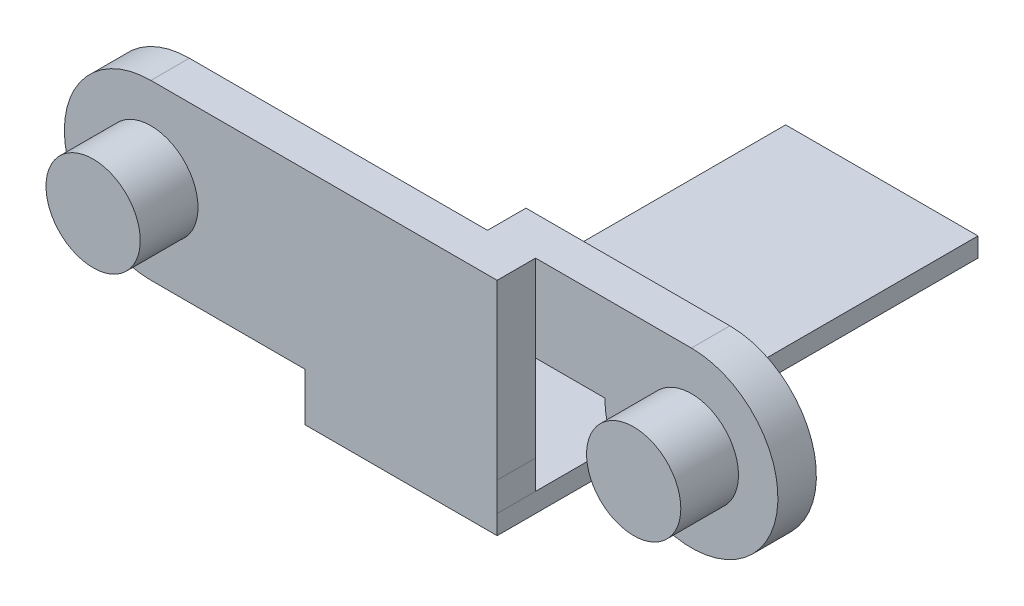
ISO-10303-21;
HEADER;
FILE_DESCRIPTION(('STEP AP214'),'2;1');
FILE_NAME('part.step','',(''),(''),'','','');
FILE_SCHEMA(('AUTOMOTIVE_DESIGN { 1 0 10303 214 1 1 1 1 }'));
ENDSEC;
DATA;
#1=APPLICATION_CONTEXT('core data for automotive mechanical design processes');
#2=APPLICATION_PROTOCOL_DEFINITION('international standard','automotive_design',2000,#1);
#3=PRODUCT_CONTEXT('',#1,'mechanical');
#4=PRODUCT('Part','Part','',(#3));
#5=PRODUCT_RELATED_PRODUCT_CATEGORY('part','',(#4));
#6=PRODUCT_DEFINITION_FORMATION('','',#4);
#7=PRODUCT_DEFINITION_CONTEXT('part definition',#1,'design');
#8=PRODUCT_DEFINITION('design','',#6,#7);
#9=PRODUCT_DEFINITION_SHAPE('','',#8);
#10=(LENGTH_UNIT() NAMED_UNIT(*) SI_UNIT(.MILLI.,.METRE.));
#11=(NAMED_UNIT(*) PLANE_ANGLE_UNIT() SI_UNIT($,.RADIAN.));
#12=(NAMED_UNIT(*) SI_UNIT($,.STERADIAN.) SOLID_ANGLE_UNIT());
#13=UNCERTAINTY_MEASURE_WITH_UNIT(LENGTH_MEASURE(1.E-05),#10,'distance_accuracy_value','');
#14=(GEOMETRIC_REPRESENTATION_CONTEXT(3) GLOBAL_UNCERTAINTY_ASSIGNED_CONTEXT((#13)) GLOBAL_UNIT_ASSIGNED_CONTEXT((#10,
#11,#12)) REPRESENTATION_CONTEXT('',''));
#15=CARTESIAN_POINT('',(0.,0.,0.));
#16=DIRECTION('',(0.,0.,1.));
#17=DIRECTION('',(1.,0.,0.));
#18=AXIS2_PLACEMENT_3D('',#15,#16,#17);
#19=CARTESIAN_POINT('',(0.,0.,0.));
#20=DIRECTION('',(0.,0.,1.));
#21=DIRECTION('',(1.,0.,0.));
#22=AXIS2_PLACEMENT_3D('',#19,#20,#21);
#23=PLANE('',#22);
#24=CARTESIAN_POINT('',(-78.460741065967,-7.81033927026465,0.));
#25=DIRECTION('',(0.,0.,1.));
#26=DIRECTION('',(1.,0.,0.));
#27=AXIS2_PLACEMENT_3D('',#24,#25,#26);
#28=CIRCLE('',#27,2.45);
#29=CARTESIAN_POINT('',(-80.6400024523847,-8.9298569385793,0.));
#30=VERTEX_POINT('',#29);
#31=CARTESIAN_POINT('',(-76.2859725964851,-6.68211850102341,0.));
#32=VERTEX_POINT('',#31);
#33=EDGE_CURVE('E55',#30,#32,#28,.T.);
#34=ORIENTED_EDGE('',*,*,#33,.T.);
#35=CARTESIAN_POINT('',(-78.4652339829028,-7.80163616933807,0.));
#36=DIRECTION('',(0.,0.,-1.));
#37=DIRECTION('',(-1.,0.,0.));
#38=AXIS2_PLACEMENT_3D('',#35,#36,#37);
#39=CIRCLE('',#38,2.45);
#40=EDGE_CURVE('E167',#32,#30,#39,.T.);
#41=ORIENTED_EDGE('',*,*,#40,.T.);
#42=EDGE_LOOP('',(#34,#41));
#43=FACE_BOUND('',#42,.T.);
#44=DIRECTION('',(1.,0.,0.));
#45=VECTOR('',#44,1.);
#46=CARTESIAN_POINT('',(0.,-13.8103392702646,0.));
#47=LINE('',#46,#45);
#48=CARTESIAN_POINT('',(-70.4585846447346,-13.8103392702646,0.));
#49=VERTEX_POINT('',#48);
#50=CARTESIAN_POINT('',(-60.4585846447346,-13.8103392702646,0.));
#51=VERTEX_POINT('',#50);
#52=EDGE_CURVE('E169',#49,#51,#47,.T.);
#53=ORIENTED_EDGE('',*,*,#52,.F.);
#54=DIRECTION('',(0.,1.,0.));
#55=VECTOR('',#54,1.);
#56=CARTESIAN_POINT('',(-70.4585846447346,0.,0.));
#57=LINE('',#56,#55);
#58=CARTESIAN_POINT('',(-70.4585846447346,-12.3103392702647,0.));
#59=VERTEX_POINT('',#58);
#60=EDGE_CURVE('E303',#49,#59,#57,.T.);
#61=ORIENTED_EDGE('',*,*,#60,.T.);
#62=DIRECTION('',(-1.,0.,0.));
#63=VECTOR('',#62,1.);
#64=CARTESIAN_POINT('',(0.,-12.3103392702647,0.));
#65=LINE('',#64,#63);
#66=CARTESIAN_POINT('',(-78.460741065967,-12.3103392702647,0.));
#67=VERTEX_POINT('',#66);
#68=EDGE_CURVE('E299',#59,#67,#65,.T.);
#69=ORIENTED_EDGE('',*,*,#68,.T.);
#70=CARTESIAN_POINT('',(-78.460741065967,-7.81033927026465,0.));
#71=DIRECTION('',(0.,0.,1.));
#72=DIRECTION('',(1.,0.,0.));
#73=AXIS2_PLACEMENT_3D('',#70,#71,#72);
#74=CIRCLE('',#73,4.5);
#75=CARTESIAN_POINT('',(-78.460741065967,-3.31033927026466,0.));
#76=VERTEX_POINT('',#75);
#77=EDGE_CURVE('E295',#76,#67,#74,.T.);
#78=ORIENTED_EDGE('',*,*,#77,.F.);
#79=DIRECTION('',(-1.,0.,0.));
#80=VECTOR('',#79,1.);
#81=CARTESIAN_POINT('',(0.,-3.31033927026466,0.));
#82=LINE('',#81,#80);
#83=CARTESIAN_POINT('',(-62.960741065967,-3.31033927026466,0.));
#84=VERTEX_POINT('',#83);
#85=EDGE_CURVE('E292',#84,#76,#82,.T.);
#86=ORIENTED_EDGE('',*,*,#85,.F.);
#87=DIRECTION('',(0.,1.,0.));
#88=VECTOR('',#87,1.);
#89=CARTESIAN_POINT('',(-62.960741065967,-3.31033927026466,0.));
#90=LINE('',#89,#88);
#91=CARTESIAN_POINT('',(-62.960741065967,-7.81033927026466,0.));
#92=VERTEX_POINT('',#91);
#93=EDGE_CURVE('E248',#92,#84,#90,.T.);
#94=ORIENTED_EDGE('',*,*,#93,.F.);
#95=DIRECTION('',(-1.,0.,0.));
#96=VECTOR('',#95,1.);
#97=CARTESIAN_POINT('',(-60.460741065967,-7.81033927026466,0.));
#98=LINE('',#97,#96);
#99=CARTESIAN_POINT('',(-60.460741065967,-7.81033927026466,0.));
#100=VERTEX_POINT('',#99);
#101=EDGE_CURVE('E241',#100,#92,#98,.T.);
#102=ORIENTED_EDGE('',*,*,#101,.F.);
#103=DIRECTION('',(0.,-1.,0.));
#104=VECTOR('',#103,1.);
#105=CARTESIAN_POINT('',(-60.460741065967,0.,0.));
#106=LINE('',#105,#104);
#107=CARTESIAN_POINT('',(-60.460741065967,-12.3103392702646,0.));
#108=VERTEX_POINT('',#107);
#109=EDGE_CURVE('E156',#100,#108,#106,.T.);
#110=ORIENTED_EDGE('',*,*,#109,.T.);
#111=DIRECTION('',(-0.00143761266932871,0.999998966634373,0.));
#112=VECTOR('',#111,1.);
#113=CARTESIAN_POINT('',(-60.478313591339,-0.0869444796839806,0.));
#114=LINE('',#113,#112);
#115=EDGE_CURVE('E306',#51,#108,#114,.T.);
#116=ORIENTED_EDGE('',*,*,#115,.F.);
#117=EDGE_LOOP('',(#53,#61,#69,#78,#86,#94,#102,#110,#116));
#118=FACE_BOUND('',#117,.T.);
#119=ADVANCED_FACE('F39',(#43,#118),#23,.F.);
#120=CARTESIAN_POINT('',(0.,-3.31033927026466,2.));
#121=DIRECTION('',(0.,-1.,0.));
#122=DIRECTION('',(1.,0.,0.));
#123=AXIS2_PLACEMENT_3D('',#120,#121,#122);
#124=PLANE('',#123);
#125=DIRECTION('',(0.,0.,-1.));
#126=VECTOR('',#125,1.);
#127=CARTESIAN_POINT('',(-60.460741065967,-3.31033927026466,2.));
#128=LINE('',#127,#126);
#129=CARTESIAN_POINT('',(-60.460741065967,-3.31033927026466,2.));
#130=VERTEX_POINT('',#129);
#131=CARTESIAN_POINT('',(-60.460741065967,-3.31033927026466,0.));
#132=VERTEX_POINT('',#131);
#133=EDGE_CURVE('E289',#130,#132,#128,.T.);
#134=ORIENTED_EDGE('',*,*,#133,.T.);
#135=DIRECTION('',(-1.,0.,0.));
#136=VECTOR('',#135,1.);
#137=CARTESIAN_POINT('',(0.,-3.31033927026466,0.));
#138=LINE('',#137,#136);
#139=CARTESIAN_POINT('',(-52.360741065967,-3.31033927026466,0.));
#140=VERTEX_POINT('',#139);
#141=EDGE_CURVE('E232',#140,#132,#138,.T.);
#142=ORIENTED_EDGE('',*,*,#141,.F.);
#143=DIRECTION('',(0.,0.,1.));
#144=VECTOR('',#143,1.);
#145=CARTESIAN_POINT('',(-52.360741065967,-3.31033927026466,-2.));
#146=LINE('',#145,#144);
#147=CARTESIAN_POINT('',(-52.360741065967,-3.31033927026466,-2.));
#148=VERTEX_POINT('',#147);
#149=EDGE_CURVE('E238',#148,#140,#146,.T.);
#150=ORIENTED_EDGE('',*,*,#149,.F.);
#151=DIRECTION('',(1.,0.,0.));
#152=VECTOR('',#151,1.);
#153=CARTESIAN_POINT('',(-60.460741065967,-3.31033927026466,-2.));
#154=LINE('',#153,#152);
#155=CARTESIAN_POINT('',(-62.960741065967,-3.31033927026466,-2.));
#156=VERTEX_POINT('',#155);
#157=EDGE_CURVE('E251',#156,#148,#154,.T.);
#158=ORIENTED_EDGE('',*,*,#157,.F.);
#159=DIRECTION('',(0.,0.,1.));
#160=VECTOR('',#159,1.);
#161=CARTESIAN_POINT('',(-62.960741065967,-3.31033927026466,-2.));
#162=LINE('',#161,#160);
#163=EDGE_CURVE('E254',#156,#84,#162,.T.);
#164=ORIENTED_EDGE('',*,*,#163,.T.);
#165=ORIENTED_EDGE('',*,*,#85,.T.);
#166=DIRECTION('',(0.,0.,-1.));
#167=VECTOR('',#166,1.);
#168=CARTESIAN_POINT('',(-78.460741065967,-3.31033927026466,2.));
#169=LINE('',#168,#167);
#170=CARTESIAN_POINT('',(-78.460741065967,-3.31033927026466,2.));
#171=VERTEX_POINT('',#170);
#172=EDGE_CURVE('E48',#171,#76,#169,.T.);
#173=ORIENTED_EDGE('',*,*,#172,.F.);
#174=DIRECTION('',(-1.,0.,0.));
#175=VECTOR('',#174,1.);
#176=CARTESIAN_POINT('',(0.,-3.31033927026466,2.));
#177=LINE('',#176,#175);
#178=EDGE_CURVE('E155',#130,#171,#177,.T.);
#179=ORIENTED_EDGE('',*,*,#178,.F.);
#180=EDGE_LOOP('',(#134,#142,#150,#158,#164,#165,#173,#179));
#181=FACE_BOUND('',#180,.T.);
#182=ADVANCED_FACE('F338',(#181),#124,.F.);
#183=CARTESIAN_POINT('',(-78.460741065967,-7.81033927026465,2.));
#184=DIRECTION('',(0.,0.,-1.));
#185=DIRECTION('',(-1.,0.,0.));
#186=AXIS2_PLACEMENT_3D('',#183,#184,#185);
#187=CYLINDRICAL_SURFACE('',#186,4.5);
#188=ORIENTED_EDGE('',*,*,#77,.T.);
#189=DIRECTION('',(0.,0.,-1.));
#190=VECTOR('',#189,1.);
#191=CARTESIAN_POINT('',(-78.460741065967,-12.3103392702647,2.));
#192=LINE('',#191,#190);
#193=CARTESIAN_POINT('',(-78.460741065967,-12.3103392702647,2.));
#194=VERTEX_POINT('',#193);
#195=EDGE_CURVE('E327',#194,#67,#192,.T.);
#196=ORIENTED_EDGE('',*,*,#195,.F.);
#197=CARTESIAN_POINT('',(-78.460741065967,-7.81033927026465,2.));
#198=DIRECTION('',(0.,0.,1.));
#199=DIRECTION('',(1.,0.,0.));
#200=AXIS2_PLACEMENT_3D('',#197,#198,#199);
#201=CIRCLE('',#200,4.5);
#202=EDGE_CURVE('E271',#171,#194,#201,.T.);
#203=ORIENTED_EDGE('',*,*,#202,.F.);
#204=ORIENTED_EDGE('',*,*,#172,.T.);
#205=EDGE_LOOP('',(#188,#196,#203,#204));
#206=FACE_BOUND('',#205,.T.);
#207=ADVANCED_FACE('F333',(#206),#187,.T.);
#208=CARTESIAN_POINT('',(0.,-12.3103392702647,2.));
#209=DIRECTION('',(0.,-1.,0.));
#210=DIRECTION('',(0.,0.,-1.));
#211=AXIS2_PLACEMENT_3D('',#208,#209,#210);
#212=PLANE('',#211);
#213=ORIENTED_EDGE('',*,*,#68,.F.);
#214=DIRECTION('',(0.,0.,-1.));
#215=VECTOR('',#214,1.);
#216=CARTESIAN_POINT('',(-70.4585846447346,-12.3103392702647,2.));
#217=LINE('',#216,#215);
#218=CARTESIAN_POINT('',(-70.4585846447346,-12.3103392702647,2.));
#219=VERTEX_POINT('',#218);
#220=EDGE_CURVE('E323',#219,#59,#217,.T.);
#221=ORIENTED_EDGE('',*,*,#220,.F.);
#222=DIRECTION('',(-1.,0.,0.));
#223=VECTOR('',#222,1.);
#224=CARTESIAN_POINT('',(0.,-12.3103392702647,2.));
#225=LINE('',#224,#223);
#226=EDGE_CURVE('E274',#219,#194,#225,.T.);
#227=ORIENTED_EDGE('',*,*,#226,.T.);
#228=ORIENTED_EDGE('',*,*,#195,.T.);
#229=EDGE_LOOP('',(#213,#221,#227,#228));
#230=FACE_BOUND('',#229,.T.);
#231=ADVANCED_FACE('F347',(#230),#212,.T.);
#232=CARTESIAN_POINT('',(-70.4585846447346,0.,2.));
#233=DIRECTION('',(-1.,0.,0.));
#234=DIRECTION('',(0.,0.,1.));
#235=AXIS2_PLACEMENT_3D('',#232,#233,#234);
#236=PLANE('',#235);
#237=ORIENTED_EDGE('',*,*,#60,.F.);
#238=DIRECTION('',(0.,0.,1.));
#239=VECTOR('',#238,1.);
#240=CARTESIAN_POINT('',(-70.4585846447346,-13.8103392702646,-23.));
#241=LINE('',#240,#239);
#242=CARTESIAN_POINT('',(-70.4585846447346,-13.8103392702646,-23.));
#243=VERTEX_POINT('',#242);
#244=EDGE_CURVE('E192',#243,#49,#241,.T.);
#245=ORIENTED_EDGE('',*,*,#244,.F.);
#246=DIRECTION('',(0.,-1.,0.));
#247=VECTOR('',#246,1.);
#248=CARTESIAN_POINT('',(-70.4585846447346,0.,-23.));
#249=LINE('',#248,#247);
#250=CARTESIAN_POINT('',(-70.4585846447346,-14.8103392702646,-23.));
#251=VERTEX_POINT('',#250);
#252=EDGE_CURVE('E183',#243,#251,#249,.T.);
#253=ORIENTED_EDGE('',*,*,#252,.T.);
#254=DIRECTION('',(0.,0.,-1.));
#255=VECTOR('',#254,1.);
#256=CARTESIAN_POINT('',(-70.4585846447346,-14.8103392702646,2.));
#257=LINE('',#256,#255);
#258=CARTESIAN_POINT('',(-70.4585846447346,-14.8103392702646,2.));
#259=VERTEX_POINT('',#258);
#260=EDGE_CURVE('E207',#259,#251,#257,.T.);
#261=ORIENTED_EDGE('',*,*,#260,.F.);
#262=DIRECTION('',(0.,1.,0.));
#263=VECTOR('',#262,1.);
#264=CARTESIAN_POINT('',(-70.4585846447346,0.,2.));
#265=LINE('',#264,#263);
#266=EDGE_CURVE('E278',#259,#219,#265,.T.);
#267=ORIENTED_EDGE('',*,*,#266,.T.);
#268=ORIENTED_EDGE('',*,*,#220,.T.);
#269=EDGE_LOOP('',(#237,#245,#253,#261,#267,#268));
#270=FACE_BOUND('',#269,.T.);
#271=ADVANCED_FACE('F352',(#270),#236,.T.);
#272=CARTESIAN_POINT('',(-60.478313591339,-0.0869444796839806,2.));
#273=DIRECTION('',(-0.999998966634373,-0.00143761266932871,0.));
#274=DIRECTION('',(0.00143761266932871,-0.999998966634373,0.));
#275=AXIS2_PLACEMENT_3D('',#272,#273,#274);
#276=PLANE('',#275);
#277=ORIENTED_EDGE('',*,*,#115,.T.);
#278=DIRECTION('',(0.,0.,-1.));
#279=VECTOR('',#278,1.);
#280=CARTESIAN_POINT('',(-60.460741065967,-12.3103392702646,2.));
#281=LINE('',#280,#279);
#282=CARTESIAN_POINT('',(-60.460741065967,-12.3103392702646,2.));
#283=VERTEX_POINT('',#282);
#284=EDGE_CURVE('E315',#283,#108,#281,.T.);
#285=ORIENTED_EDGE('',*,*,#284,.F.);
#286=DIRECTION('',(-0.00143761266932871,0.999998966634373,0.));
#287=VECTOR('',#286,1.);
#288=CARTESIAN_POINT('',(-60.478313591339,-0.0869444796839806,2.));
#289=LINE('',#288,#287);
#290=CARTESIAN_POINT('',(-60.4585846447346,-13.8103392702646,2.));
#291=VERTEX_POINT('',#290);
#292=EDGE_CURVE('E282',#291,#283,#289,.T.);
#293=ORIENTED_EDGE('',*,*,#292,.F.);
#294=DIRECTION('',(0.,0.,-1.));
#295=VECTOR('',#294,1.);
#296=CARTESIAN_POINT('',(-60.4585846447346,-13.8103392702646,2.));
#297=LINE('',#296,#295);
#298=EDGE_CURVE('E319',#291,#51,#297,.T.);
#299=ORIENTED_EDGE('',*,*,#298,.T.);
#300=EDGE_LOOP('',(#277,#285,#293,#299));
#301=FACE_BOUND('',#300,.T.);
#302=ADVANCED_FACE('F367',(#301),#276,.F.);
#303=CARTESIAN_POINT('',(-78.460741065967,-7.81033927026465,2.));
#304=DIRECTION('',(0.,0.,-1.));
#305=DIRECTION('',(-1.,0.,0.));
#306=AXIS2_PLACEMENT_3D('',#303,#304,#305);
#307=CYLINDRICAL_SURFACE('',#306,2.45);
#308=DIRECTION('',(0.,0.,-1.));
#309=VECTOR('',#308,1.);
#310=CARTESIAN_POINT('',(-76.2859725964851,-6.68211850102341,2.5));
#311=LINE('',#310,#309);
#312=CARTESIAN_POINT('',(-76.2859725964851,-6.68211850102341,2.));
#313=VERTEX_POINT('',#312);
#314=EDGE_CURVE('E60',#32,#313,#311,.F.);
#315=ORIENTED_EDGE('',*,*,#314,.F.);
#316=ORIENTED_EDGE('',*,*,#33,.F.);
#317=DIRECTION('',(0.,0.,-1.));
#318=VECTOR('',#317,1.);
#319=CARTESIAN_POINT('',(-80.6400024523847,-8.9298569385793,2.5));
#320=LINE('',#319,#318);
#321=CARTESIAN_POINT('',(-80.6400024523847,-8.92985693857931,2.));
#322=VERTEX_POINT('',#321);
#323=EDGE_CURVE('E158',#322,#30,#320,.T.);
#324=ORIENTED_EDGE('',*,*,#323,.F.);
#325=CARTESIAN_POINT('',(-78.460741065967,-7.81033927026465,2.));
#326=DIRECTION('',(0.,0.,1.));
#327=DIRECTION('',(1.,0.,0.));
#328=AXIS2_PLACEMENT_3D('',#325,#326,#327);
#329=CIRCLE('',#328,2.45);
#330=EDGE_CURVE('E151',#322,#313,#329,.T.);
#331=ORIENTED_EDGE('',*,*,#330,.T.);
#332=EDGE_LOOP('',(#315,#316,#324,#331));
#333=FACE_BOUND('',#332,.T.);
#334=ADVANCED_FACE('F41',(#333),#307,.F.);
#335=CARTESIAN_POINT('',(-60.460741065967,0.,2.));
#336=DIRECTION('',(1.,0.,0.));
#337=DIRECTION('',(0.,0.,-1.));
#338=AXIS2_PLACEMENT_3D('',#335,#336,#337);
#339=PLANE('',#338);
#340=DIRECTION('',(0.,1.,0.));
#341=VECTOR('',#340,1.);
#342=CARTESIAN_POINT('',(-60.460741065967,0.,0.));
#343=LINE('',#342,#341);
#344=EDGE_CURVE('E224',#100,#132,#343,.T.);
#345=ORIENTED_EDGE('',*,*,#344,.T.);
#346=ORIENTED_EDGE('',*,*,#133,.F.);
#347=DIRECTION('',(0.,-1.,0.));
#348=VECTOR('',#347,1.);
#349=CARTESIAN_POINT('',(-60.460741065967,0.,2.));
#350=LINE('',#349,#348);
#351=EDGE_CURVE('E285',#130,#283,#350,.T.);
#352=ORIENTED_EDGE('',*,*,#351,.T.);
#353=ORIENTED_EDGE('',*,*,#284,.T.);
#354=ORIENTED_EDGE('',*,*,#109,.F.);
#355=EDGE_LOOP('',(#345,#346,#352,#353,#354));
#356=FACE_BOUND('',#355,.T.);
#357=ADVANCED_FACE('F371',(#356),#339,.T.);
#358=CARTESIAN_POINT('',(0.,0.,2.));
#359=DIRECTION('',(0.,0.,1.));
#360=DIRECTION('',(1.,0.,0.));
#361=AXIS2_PLACEMENT_3D('',#358,#359,#360);
#362=PLANE('',#361);
#363=CARTESIAN_POINT('',(-78.4652339829028,-7.80163616933807,2.));
#364=DIRECTION('',(0.,0.,1.));
#365=DIRECTION('',(1.,0.,0.));
#366=AXIS2_PLACEMENT_3D('',#363,#364,#365);
#367=CIRCLE('',#366,2.45);
#368=EDGE_CURVE('E11',#313,#322,#367,.T.);
#369=ORIENTED_EDGE('',*,*,#368,.F.);
#370=ORIENTED_EDGE('',*,*,#330,.F.);
#371=EDGE_LOOP('',(#369,#370));
#372=FACE_BOUND('',#371,.T.);
#373=ORIENTED_EDGE('',*,*,#178,.T.);
#374=ORIENTED_EDGE('',*,*,#202,.T.);
#375=ORIENTED_EDGE('',*,*,#226,.F.);
#376=ORIENTED_EDGE('',*,*,#266,.F.);
#377=DIRECTION('',(1.,0.,0.));
#378=VECTOR('',#377,1.);
#379=CARTESIAN_POINT('',(-70.4585846447346,-14.8103392702646,2.));
#380=LINE('',#379,#378);
#381=CARTESIAN_POINT('',(-60.4585846447346,-14.8103392702646,2.));
#382=VERTEX_POINT('',#381);
#383=EDGE_CURVE('E195',#259,#382,#380,.T.);
#384=ORIENTED_EDGE('',*,*,#383,.T.);
#385=DIRECTION('',(0.,1.,0.));
#386=VECTOR('',#385,1.);
#387=CARTESIAN_POINT('',(-60.4585846447346,-13.8103392702646,2.));
#388=LINE('',#387,#386);
#389=EDGE_CURVE('E200',#382,#291,#388,.T.);
#390=ORIENTED_EDGE('',*,*,#389,.T.);
#391=ORIENTED_EDGE('',*,*,#292,.T.);
#392=ORIENTED_EDGE('',*,*,#351,.F.);
#393=EDGE_LOOP('',(#373,#374,#375,#376,#384,#390,#391,#392));
#394=FACE_BOUND('',#393,.T.);
#395=ADVANCED_FACE('F152',(#372,#394),#362,.T.);
#396=CARTESIAN_POINT('',(-60.460741065967,-7.81033927026466,-2.));
#397=DIRECTION('',(0.,1.,0.));
#398=DIRECTION('',(0.,0.,1.));
#399=AXIS2_PLACEMENT_3D('',#396,#397,#398);
#400=PLANE('',#399);
#401=ORIENTED_EDGE('',*,*,#101,.T.);
#402=DIRECTION('',(0.,0.,1.));
#403=VECTOR('',#402,1.);
#404=CARTESIAN_POINT('',(-62.960741065967,-7.81033927026466,-2.));
#405=LINE('',#404,#403);
#406=CARTESIAN_POINT('',(-62.960741065967,-7.81033927026466,-2.));
#407=VERTEX_POINT('',#406);
#408=EDGE_CURVE('E264',#407,#92,#405,.T.);
#409=ORIENTED_EDGE('',*,*,#408,.F.);
#410=DIRECTION('',(-1.,0.,0.));
#411=VECTOR('',#410,1.);
#412=CARTESIAN_POINT('',(-60.460741065967,-7.81033927026466,-2.));
#413=LINE('',#412,#411);
#414=CARTESIAN_POINT('',(-56.860741065967,-7.81033927026466,-2.));
#415=VERTEX_POINT('',#414);
#416=EDGE_CURVE('E244',#415,#407,#413,.T.);
#417=ORIENTED_EDGE('',*,*,#416,.F.);
#418=DIRECTION('',(0.,0.,1.));
#419=VECTOR('',#418,1.);
#420=CARTESIAN_POINT('',(-56.860741065967,-7.81033927026466,-2.));
#421=LINE('',#420,#419);
#422=CARTESIAN_POINT('',(-56.860741065967,-7.81033927026466,0.));
#423=VERTEX_POINT('',#422);
#424=EDGE_CURVE('E223',#415,#423,#421,.T.);
#425=ORIENTED_EDGE('',*,*,#424,.T.);
#426=DIRECTION('',(-1.,0.,0.));
#427=VECTOR('',#426,1.);
#428=CARTESIAN_POINT('',(0.,-7.81033927026466,0.));
#429=LINE('',#428,#427);
#430=EDGE_CURVE('E215',#423,#100,#429,.T.);
#431=ORIENTED_EDGE('',*,*,#430,.T.);
#432=EDGE_LOOP('',(#401,#409,#417,#425,#431));
#433=FACE_BOUND('',#432,.T.);
#434=ADVANCED_FACE('F389',(#433),#400,.F.);
#435=CARTESIAN_POINT('',(-62.960741065967,-3.31033927026466,-2.));
#436=DIRECTION('',(1.,0.,0.));
#437=DIRECTION('',(0.,0.,-1.));
#438=AXIS2_PLACEMENT_3D('',#435,#436,#437);
#439=PLANE('',#438);
#440=ORIENTED_EDGE('',*,*,#93,.T.);
#441=ORIENTED_EDGE('',*,*,#163,.F.);
#442=DIRECTION('',(0.,1.,0.));
#443=VECTOR('',#442,1.);
#444=CARTESIAN_POINT('',(-62.960741065967,-3.31033927026466,-2.));
#445=LINE('',#444,#443);
#446=EDGE_CURVE('E247',#407,#156,#445,.T.);
#447=ORIENTED_EDGE('',*,*,#446,.F.);
#448=ORIENTED_EDGE('',*,*,#408,.T.);
#449=EDGE_LOOP('',(#440,#441,#447,#448));
#450=FACE_BOUND('',#449,.T.);
#451=ADVANCED_FACE('F387',(#450),#439,.F.);
#452=CARTESIAN_POINT('',(0.,0.,-2.));
#453=DIRECTION('',(0.,0.,-1.));
#454=DIRECTION('',(-1.,0.,0.));
#455=AXIS2_PLACEMENT_3D('',#452,#453,#454);
#456=PLANE('',#455);
#457=ORIENTED_EDGE('',*,*,#157,.T.);
#458=CARTESIAN_POINT('',(-52.360741065967,-7.81033927026465,-2.));
#459=DIRECTION('',(0.,0.,1.));
#460=DIRECTION('',(1.,0.,0.));
#461=AXIS2_PLACEMENT_3D('',#458,#459,#460);
#462=CIRCLE('',#461,4.5);
#463=EDGE_CURVE('E219',#415,#148,#462,.T.);
#464=ORIENTED_EDGE('',*,*,#463,.F.);
#465=ORIENTED_EDGE('',*,*,#416,.T.);
#466=ORIENTED_EDGE('',*,*,#446,.T.);
#467=EDGE_LOOP('',(#457,#464,#465,#466));
#468=FACE_BOUND('',#467,.T.);
#469=ADVANCED_FACE('F383',(#468),#456,.T.);
#470=CARTESIAN_POINT('',(-52.360741065967,-7.81033927026465,-2.));
#471=DIRECTION('',(0.,0.,1.));
#472=DIRECTION('',(1.,0.,0.));
#473=AXIS2_PLACEMENT_3D('',#470,#471,#472);
#474=CYLINDRICAL_SURFACE('',#473,4.5);
#475=CARTESIAN_POINT('',(-52.360741065967,-7.81033927026465,0.));
#476=DIRECTION('',(0.,0.,1.));
#477=DIRECTION('',(1.,0.,0.));
#478=AXIS2_PLACEMENT_3D('',#475,#476,#477);
#479=CIRCLE('',#478,4.5);
#480=EDGE_CURVE('E228',#423,#140,#479,.T.);
#481=ORIENTED_EDGE('',*,*,#480,.F.);
#482=ORIENTED_EDGE('',*,*,#424,.F.);
#483=ORIENTED_EDGE('',*,*,#463,.T.);
#484=ORIENTED_EDGE('',*,*,#149,.T.);
#485=EDGE_LOOP('',(#481,#482,#483,#484));
#486=FACE_BOUND('',#485,.T.);
#487=ADVANCED_FACE('F380',(#486),#474,.T.);
#488=CARTESIAN_POINT('',(0.,0.,0.));
#489=DIRECTION('',(0.,0.,1.));
#490=DIRECTION('',(1.,0.,0.));
#491=AXIS2_PLACEMENT_3D('',#488,#489,#490);
#492=PLANE('',#491);
#493=CARTESIAN_POINT('',(-52.360741065967,-7.81033927026465,0.));
#494=DIRECTION('',(0.,0.,1.));
#495=DIRECTION('',(1.,0.,0.));
#496=AXIS2_PLACEMENT_3D('',#493,#494,#495);
#497=CIRCLE('',#496,2.44999999999822);
#498=CARTESIAN_POINT('',(-49.9107410659688,-7.81033927026465,0.));
#499=VERTEX_POINT('',#498);
#500=EDGE_CURVE('E210',#499,#499,#497,.T.);
#501=ORIENTED_EDGE('',*,*,#500,.F.);
#502=EDGE_LOOP('',(#501));
#503=FACE_BOUND('',#502,.T.);
#504=ORIENTED_EDGE('',*,*,#430,.F.);
#505=ORIENTED_EDGE('',*,*,#480,.T.);
#506=ORIENTED_EDGE('',*,*,#141,.T.);
#507=ORIENTED_EDGE('',*,*,#344,.F.);
#508=EDGE_LOOP('',(#504,#505,#506,#507));
#509=FACE_BOUND('',#508,.T.);
#510=ADVANCED_FACE('F377',(#503,#509),#492,.T.);
#511=CARTESIAN_POINT('',(-52.360741065967,-7.81033927026465,3.));
#512=DIRECTION('',(0.,0.,-1.));
#513=DIRECTION('',(-1.,0.,0.));
#514=AXIS2_PLACEMENT_3D('',#511,#512,#513);
#515=CYLINDRICAL_SURFACE('',#514,2.44999999999822);
#516=CARTESIAN_POINT('',(-52.360741065967,-7.81033927026465,3.));
#517=DIRECTION('',(0.,0.,1.));
#518=DIRECTION('',(1.,0.,0.));
#519=AXIS2_PLACEMENT_3D('',#516,#517,#518);
#520=CIRCLE('',#519,2.44999999999822);
#521=CARTESIAN_POINT('',(-49.9107410659688,-7.81033927026465,3.));
#522=VERTEX_POINT('',#521);
#523=EDGE_CURVE('E211',#522,#522,#520,.T.);
#524=ORIENTED_EDGE('',*,*,#523,.F.);
#525=EDGE_LOOP('',(#524));
#526=FACE_BOUND('',#525,.T.);
#527=ORIENTED_EDGE('',*,*,#500,.T.);
#528=EDGE_LOOP('',(#527));
#529=FACE_BOUND('',#528,.T.);
#530=ADVANCED_FACE('F490',(#526,#529),#515,.T.);
#531=CARTESIAN_POINT('',(-52.360741065967,-7.81033927026465,3.));
#532=DIRECTION('',(0.,0.,1.));
#533=DIRECTION('',(1.,0.,0.));
#534=AXIS2_PLACEMENT_3D('',#531,#532,#533);
#535=PLANE('',#534);
#536=ORIENTED_EDGE('',*,*,#523,.T.);
#537=EDGE_LOOP('',(#536));
#538=FACE_BOUND('',#537,.T.);
#539=ADVANCED_FACE('F487',(#538),#535,.T.);
#540=CARTESIAN_POINT('',(-70.4585846447346,-14.8103392702646,2.));
#541=DIRECTION('',(0.,1.,0.));
#542=DIRECTION('',(0.,0.,1.));
#543=AXIS2_PLACEMENT_3D('',#540,#541,#542);
#544=PLANE('',#543);
#545=ORIENTED_EDGE('',*,*,#260,.T.);
#546=DIRECTION('',(1.,0.,0.));
#547=VECTOR('',#546,1.);
#548=CARTESIAN_POINT('',(0.,-14.8103392702646,-23.));
#549=LINE('',#548,#547);
#550=CARTESIAN_POINT('',(-60.4585846447346,-14.8103392702646,-23.));
#551=VERTEX_POINT('',#550);
#552=EDGE_CURVE('E187',#251,#551,#549,.T.);
#553=ORIENTED_EDGE('',*,*,#552,.T.);
#554=DIRECTION('',(0.,0.,-1.));
#555=VECTOR('',#554,1.);
#556=CARTESIAN_POINT('',(-60.4585846447346,-14.8103392702646,2.));
#557=LINE('',#556,#555);
#558=EDGE_CURVE('E204',#382,#551,#557,.T.);
#559=ORIENTED_EDGE('',*,*,#558,.F.);
#560=ORIENTED_EDGE('',*,*,#383,.F.);
#561=EDGE_LOOP('',(#545,#553,#559,#560));
#562=FACE_BOUND('',#561,.T.);
#563=ADVANCED_FACE('F356',(#562),#544,.F.);
#564=CARTESIAN_POINT('',(-60.4585846447346,-13.8103392702646,2.));
#565=DIRECTION('',(-1.,0.,0.));
#566=DIRECTION('',(0.,0.,1.));
#567=AXIS2_PLACEMENT_3D('',#564,#565,#566);
#568=PLANE('',#567);
#569=ORIENTED_EDGE('',*,*,#558,.T.);
#570=DIRECTION('',(0.,-1.,0.));
#571=VECTOR('',#570,1.);
#572=CARTESIAN_POINT('',(-60.4585846447346,0.,-23.));
#573=LINE('',#572,#571);
#574=CARTESIAN_POINT('',(-60.4585846447346,-13.8103392702646,-23.));
#575=VERTEX_POINT('',#574);
#576=EDGE_CURVE('E173',#575,#551,#573,.T.);
#577=ORIENTED_EDGE('',*,*,#576,.F.);
#578=DIRECTION('',(0.,0.,1.));
#579=VECTOR('',#578,1.);
#580=CARTESIAN_POINT('',(-60.4585846447346,-13.8103392702646,-23.));
#581=LINE('',#580,#579);
#582=EDGE_CURVE('E190',#575,#51,#581,.T.);
#583=ORIENTED_EDGE('',*,*,#582,.T.);
#584=ORIENTED_EDGE('',*,*,#298,.F.);
#585=ORIENTED_EDGE('',*,*,#389,.F.);
#586=EDGE_LOOP('',(#569,#577,#583,#584,#585));
#587=FACE_BOUND('',#586,.T.);
#588=ADVANCED_FACE('F362',(#587),#568,.F.);
#589=CARTESIAN_POINT('',(0.,-13.8103392702646,-23.));
#590=DIRECTION('',(0.,-1.,0.));
#591=DIRECTION('',(0.,0.,-1.));
#592=AXIS2_PLACEMENT_3D('',#589,#590,#591);
#593=PLANE('',#592);
#594=ORIENTED_EDGE('',*,*,#52,.T.);
#595=ORIENTED_EDGE('',*,*,#582,.F.);
#596=DIRECTION('',(1.,0.,0.));
#597=VECTOR('',#596,1.);
#598=CARTESIAN_POINT('',(0.,-13.8103392702646,-23.));
#599=LINE('',#598,#597);
#600=EDGE_CURVE('E180',#243,#575,#599,.T.);
#601=ORIENTED_EDGE('',*,*,#600,.F.);
#602=ORIENTED_EDGE('',*,*,#244,.T.);
#603=EDGE_LOOP('',(#594,#595,#601,#602));
#604=FACE_BOUND('',#603,.T.);
#605=ADVANCED_FACE('F478',(#604),#593,.F.);
#606=CARTESIAN_POINT('',(0.,0.,-23.));
#607=DIRECTION('',(0.,0.,1.));
#608=DIRECTION('',(1.,0.,0.));
#609=AXIS2_PLACEMENT_3D('',#606,#607,#608);
#610=PLANE('',#609);
#611=ORIENTED_EDGE('',*,*,#576,.T.);
#612=ORIENTED_EDGE('',*,*,#552,.F.);
#613=ORIENTED_EDGE('',*,*,#252,.F.);
#614=ORIENTED_EDGE('',*,*,#600,.T.);
#615=EDGE_LOOP('',(#611,#612,#613,#614));
#616=FACE_BOUND('',#615,.T.);
#617=ADVANCED_FACE('F461',(#616),#610,.F.);
#618=CARTESIAN_POINT('',(-78.4652339829028,-7.80163616933807,5.));
#619=DIRECTION('',(0.,0.,-1.));
#620=DIRECTION('',(-1.,0.,0.));
#621=AXIS2_PLACEMENT_3D('',#618,#619,#620);
#622=CYLINDRICAL_SURFACE('',#621,2.45);
#623=ORIENTED_EDGE('',*,*,#40,.F.);
#624=ORIENTED_EDGE('',*,*,#314,.T.);
#625=ORIENTED_EDGE('',*,*,#368,.T.);
#626=ORIENTED_EDGE('',*,*,#323,.T.);
#627=EDGE_LOOP('',(#623,#624,#625,#626));
#628=FACE_BOUND('',#627,.T.);
#629=CARTESIAN_POINT('',(-78.4652339829028,-7.80163616933807,5.));
#630=DIRECTION('',(0.,0.,-1.));
#631=DIRECTION('',(-1.,0.,0.));
#632=AXIS2_PLACEMENT_3D('',#629,#630,#631);
#633=CIRCLE('',#632,2.45);
#634=CARTESIAN_POINT('',(-80.9152339829028,-7.80163616933807,5.));
#635=VERTEX_POINT('',#634);
#636=EDGE_CURVE('E163',#635,#635,#633,.T.);
#637=ORIENTED_EDGE('',*,*,#636,.T.);
#638=EDGE_LOOP('',(#637));
#639=FACE_BOUND('',#638,.T.);
#640=ADVANCED_FACE('F165',(#628,#639),#622,.T.);
#641=CARTESIAN_POINT('',(-78.4652339829028,-7.80163616933807,5.));
#642=DIRECTION('',(0.,0.,-1.));
#643=DIRECTION('',(-1.,0.,0.));
#644=AXIS2_PLACEMENT_3D('',#641,#642,#643);
#645=PLANE('',#644);
#646=ORIENTED_EDGE('',*,*,#636,.F.);
#647=EDGE_LOOP('',(#646));
#648=FACE_BOUND('',#647,.T.);
#649=ADVANCED_FACE('F460',(#648),#645,.F.);
#650=CLOSED_SHELL('',(#119,#182,#207,#231,#271,#302,#334,#357,#395,#434,#451,#469,#487,#510,
#530,#539,#563,#588,#605,#617,#640,#649));
#651=MANIFOLD_SOLID_BREP('B2',#650);
#652=ADVANCED_BREP_SHAPE_REPRESENTATION('',(#18,#651),#14);
#653=SHAPE_DEFINITION_REPRESENTATION(#9,#652);
ENDSEC;
END-ISO-10303-21;
